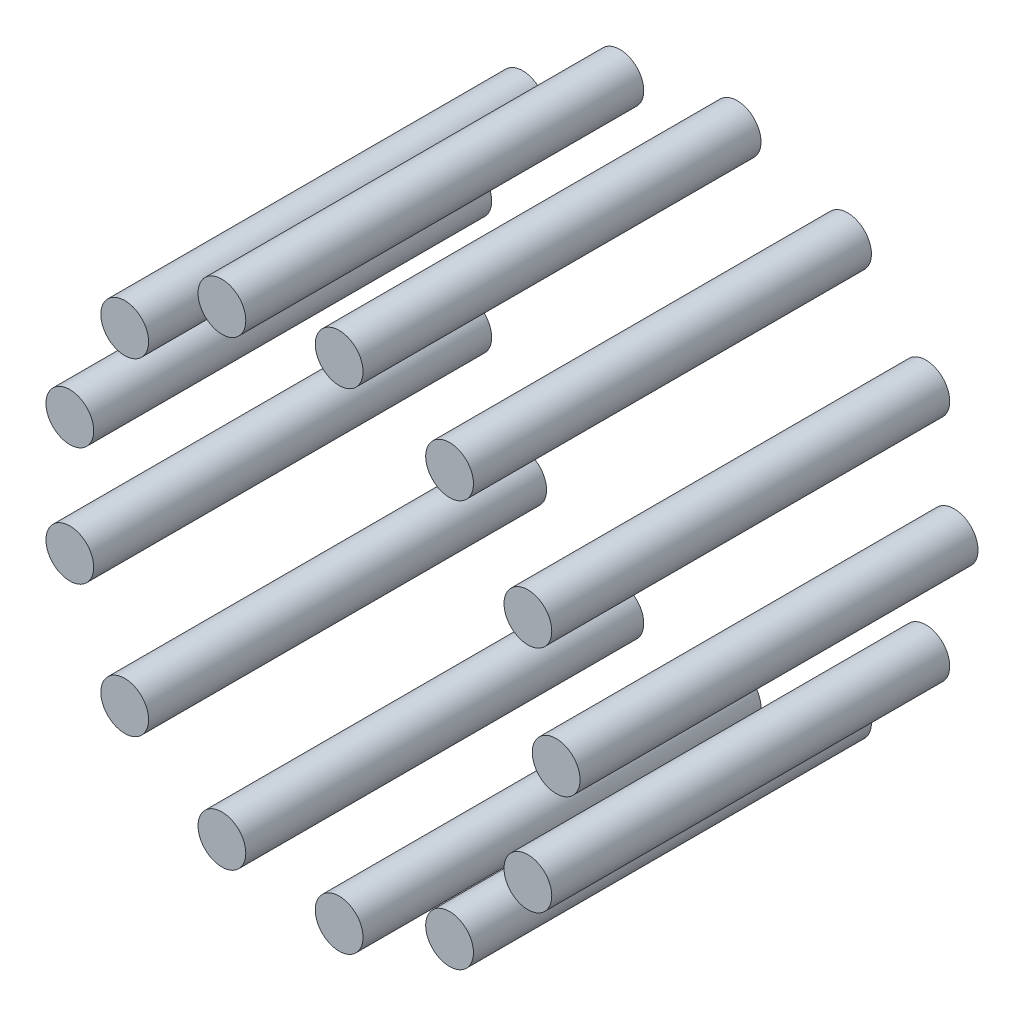
ISO-10303-21;
HEADER;
FILE_DESCRIPTION(('STEP AP214'),'2;1');
FILE_NAME('part.step','',(''),(''),'','','');
FILE_SCHEMA(('AUTOMOTIVE_DESIGN { 1 0 10303 214 1 1 1 1 }'));
ENDSEC;
DATA;
#1=APPLICATION_CONTEXT('core data for automotive mechanical design processes');
#2=APPLICATION_PROTOCOL_DEFINITION('international standard','automotive_design',2000,#1);
#3=PRODUCT_CONTEXT('',#1,'mechanical');
#4=PRODUCT('Part','Part','',(#3));
#5=PRODUCT_RELATED_PRODUCT_CATEGORY('part','',(#4));
#6=PRODUCT_DEFINITION_FORMATION('','',#4);
#7=PRODUCT_DEFINITION_CONTEXT('part definition',#1,'design');
#8=PRODUCT_DEFINITION('design','',#6,#7);
#9=PRODUCT_DEFINITION_SHAPE('','',#8);
#10=(LENGTH_UNIT() NAMED_UNIT(*) SI_UNIT(.MILLI.,.METRE.));
#11=(NAMED_UNIT(*) PLANE_ANGLE_UNIT() SI_UNIT($,.RADIAN.));
#12=(NAMED_UNIT(*) SI_UNIT($,.STERADIAN.) SOLID_ANGLE_UNIT());
#13=UNCERTAINTY_MEASURE_WITH_UNIT(LENGTH_MEASURE(1.E-05),#10,'distance_accuracy_value','');
#14=(GEOMETRIC_REPRESENTATION_CONTEXT(3) GLOBAL_UNCERTAINTY_ASSIGNED_CONTEXT((#13)) GLOBAL_UNIT_ASSIGNED_CONTEXT((#10,
#11,#12)) REPRESENTATION_CONTEXT('',''));
#15=CARTESIAN_POINT('',(0.,0.,0.));
#16=DIRECTION('',(0.,0.,1.));
#17=DIRECTION('',(1.,0.,0.));
#18=AXIS2_PLACEMENT_3D('',#15,#16,#17);
#19=CARTESIAN_POINT('',(27.4491367952504,14.4064183333573,50.));
#20=DIRECTION('',(0.,0.,-1.));
#21=DIRECTION('',(-1.,0.,0.));
#22=AXIS2_PLACEMENT_3D('',#19,#20,#21);
#23=CYLINDRICAL_SURFACE('',#22,2.99999999999889);
#24=CARTESIAN_POINT('',(27.4491367952504,14.4064183333573,50.));
#25=DIRECTION('',(0.,0.,1.));
#26=DIRECTION('',(1.,0.,0.));
#27=AXIS2_PLACEMENT_3D('',#24,#25,#26);
#28=CIRCLE('',#27,2.99999999999889);
#29=CARTESIAN_POINT('',(30.4491367952493,14.4064183333573,50.));
#30=VERTEX_POINT('',#29);
#31=EDGE_CURVE('E56',#30,#30,#28,.T.);
#32=ORIENTED_EDGE('',*,*,#31,.F.);
#33=EDGE_LOOP('',(#32));
#34=FACE_BOUND('',#33,.T.);
#35=CARTESIAN_POINT('',(27.4491367952504,14.4064183333573,0.));
#36=DIRECTION('',(0.,0.,1.));
#37=DIRECTION('',(1.,0.,0.));
#38=AXIS2_PLACEMENT_3D('',#35,#36,#37);
#39=CIRCLE('',#38,2.99999999999889);
#40=CARTESIAN_POINT('',(30.4491367952493,14.4064183333573,0.));
#41=VERTEX_POINT('',#40);
#42=EDGE_CURVE('E11',#41,#41,#39,.T.);
#43=ORIENTED_EDGE('',*,*,#42,.T.);
#44=EDGE_LOOP('',(#43));
#45=FACE_BOUND('',#44,.T.);
#46=ADVANCED_FACE('F52',(#34,#45),#23,.T.);
#47=CARTESIAN_POINT('',(27.4491367952504,14.4064183333573,50.));
#48=DIRECTION('',(0.,0.,1.));
#49=DIRECTION('',(1.,0.,0.));
#50=AXIS2_PLACEMENT_3D('',#47,#48,#49);
#51=PLANE('',#50);
#52=ORIENTED_EDGE('',*,*,#31,.T.);
#53=EDGE_LOOP('',(#52));
#54=FACE_BOUND('',#53,.T.);
#55=ADVANCED_FACE('F54',(#54),#51,.T.);
#56=CARTESIAN_POINT('',(27.4491367952504,14.4064183333573,0.));
#57=DIRECTION('',(0.,0.,1.));
#58=DIRECTION('',(1.,0.,0.));
#59=AXIS2_PLACEMENT_3D('',#56,#57,#58);
#60=PLANE('',#59);
#61=ORIENTED_EDGE('',*,*,#42,.F.);
#62=EDGE_LOOP('',(#61));
#63=FACE_BOUND('',#62,.T.);
#64=ADVANCED_FACE('F71',(#63),#60,.F.);
#65=CLOSED_SHELL('',(#46,#55,#64));
#66=MANIFOLD_SOLID_BREP('B2',#65);
#67=CARTESIAN_POINT('',(17.6100071486674,25.5124998427047,50.));
#68=DIRECTION('',(0.,0.,-1.));
#69=DIRECTION('',(-1.,0.,0.));
#70=AXIS2_PLACEMENT_3D('',#67,#68,#69);
#71=CYLINDRICAL_SURFACE('',#70,2.99999999999815);
#72=CARTESIAN_POINT('',(17.6100071486674,25.5124998427047,50.));
#73=DIRECTION('',(0.,0.,1.));
#74=DIRECTION('',(1.,0.,0.));
#75=AXIS2_PLACEMENT_3D('',#72,#73,#74);
#76=CIRCLE('',#75,2.99999999999815);
#77=CARTESIAN_POINT('',(20.6100071486655,25.5124998427047,50.));
#78=VERTEX_POINT('',#77);
#79=EDGE_CURVE('E105',#78,#78,#76,.T.);
#80=ORIENTED_EDGE('',*,*,#79,.F.);
#81=EDGE_LOOP('',(#80));
#82=FACE_BOUND('',#81,.T.);
#83=CARTESIAN_POINT('',(17.6100071486674,25.5124998427047,0.));
#84=DIRECTION('',(0.,0.,1.));
#85=DIRECTION('',(1.,0.,0.));
#86=AXIS2_PLACEMENT_3D('',#83,#84,#85);
#87=CIRCLE('',#86,2.99999999999815);
#88=CARTESIAN_POINT('',(20.6100071486655,25.5124998427047,0.));
#89=VERTEX_POINT('',#88);
#90=EDGE_CURVE('E51',#89,#89,#87,.T.);
#91=ORIENTED_EDGE('',*,*,#90,.T.);
#92=EDGE_LOOP('',(#91));
#93=FACE_BOUND('',#92,.T.);
#94=ADVANCED_FACE('F101',(#82,#93),#71,.T.);
#95=CARTESIAN_POINT('',(17.6100071486674,25.5124998427047,50.));
#96=DIRECTION('',(0.,0.,1.));
#97=DIRECTION('',(1.,0.,0.));
#98=AXIS2_PLACEMENT_3D('',#95,#96,#97);
#99=PLANE('',#98);
#100=ORIENTED_EDGE('',*,*,#79,.T.);
#101=EDGE_LOOP('',(#100));
#102=FACE_BOUND('',#101,.T.);
#103=ADVANCED_FACE('F103',(#102),#99,.T.);
#104=CARTESIAN_POINT('',(17.6100071486674,25.5124998427047,0.));
#105=DIRECTION('',(0.,0.,1.));
#106=DIRECTION('',(1.,0.,0.));
#107=AXIS2_PLACEMENT_3D('',#104,#105,#106);
#108=PLANE('',#107);
#109=ORIENTED_EDGE('',*,*,#90,.F.);
#110=EDGE_LOOP('',(#109));
#111=FACE_BOUND('',#110,.T.);
#112=ADVANCED_FACE('F120',(#111),#108,.F.);
#113=CLOSED_SHELL('',(#94,#103,#112));
#114=MANIFOLD_SOLID_BREP('B6',#113);
#115=CARTESIAN_POINT('',(3.73663708791669,30.773975097042,50.));
#116=DIRECTION('',(0.,0.,-1.));
#117=DIRECTION('',(-1.,0.,0.));
#118=AXIS2_PLACEMENT_3D('',#115,#116,#117);
#119=CYLINDRICAL_SURFACE('',#118,2.99999999999788);
#120=CARTESIAN_POINT('',(3.73663708791669,30.773975097042,50.));
#121=DIRECTION('',(0.,0.,1.));
#122=DIRECTION('',(1.,0.,0.));
#123=AXIS2_PLACEMENT_3D('',#120,#121,#122);
#124=CIRCLE('',#123,2.99999999999788);
#125=CARTESIAN_POINT('',(6.73663708791456,30.773975097042,50.));
#126=VERTEX_POINT('',#125);
#127=EDGE_CURVE('E154',#126,#126,#124,.T.);
#128=ORIENTED_EDGE('',*,*,#127,.F.);
#129=EDGE_LOOP('',(#128));
#130=FACE_BOUND('',#129,.T.);
#131=CARTESIAN_POINT('',(3.73663708791669,30.773975097042,0.));
#132=DIRECTION('',(0.,0.,1.));
#133=DIRECTION('',(1.,0.,0.));
#134=AXIS2_PLACEMENT_3D('',#131,#132,#133);
#135=CIRCLE('',#134,2.99999999999788);
#136=CARTESIAN_POINT('',(6.73663708791456,30.773975097042,0.));
#137=VERTEX_POINT('',#136);
#138=EDGE_CURVE('E100',#137,#137,#135,.T.);
#139=ORIENTED_EDGE('',*,*,#138,.T.);
#140=EDGE_LOOP('',(#139));
#141=FACE_BOUND('',#140,.T.);
#142=ADVANCED_FACE('F150',(#130,#141),#119,.T.);
#143=CARTESIAN_POINT('',(3.73663708791669,30.773975097042,50.));
#144=DIRECTION('',(0.,0.,1.));
#145=DIRECTION('',(1.,0.,0.));
#146=AXIS2_PLACEMENT_3D('',#143,#144,#145);
#147=PLANE('',#146);
#148=ORIENTED_EDGE('',*,*,#127,.T.);
#149=EDGE_LOOP('',(#148));
#150=FACE_BOUND('',#149,.T.);
#151=ADVANCED_FACE('F152',(#150),#147,.T.);
#152=CARTESIAN_POINT('',(3.73663708791669,30.773975097042,0.));
#153=DIRECTION('',(0.,0.,1.));
#154=DIRECTION('',(1.,0.,0.));
#155=AXIS2_PLACEMENT_3D('',#152,#153,#154);
#156=PLANE('',#155);
#157=ORIENTED_EDGE('',*,*,#138,.F.);
#158=EDGE_LOOP('',(#157));
#159=FACE_BOUND('',#158,.T.);
#160=ADVANCED_FACE('F169',(#159),#156,.F.);
#161=CLOSED_SHELL('',(#142,#151,#160));
#162=MANIFOLD_SOLID_BREP('B46',#161);
#163=CARTESIAN_POINT('',(-10.9927514983173,28.9855035232512,50.));
#164=DIRECTION('',(0.,0.,-1.));
#165=DIRECTION('',(-1.,0.,0.));
#166=AXIS2_PLACEMENT_3D('',#163,#164,#165);
#167=CYLINDRICAL_SURFACE('',#166,2.99999999999808);
#168=CARTESIAN_POINT('',(-10.9927514983173,28.9855035232512,50.));
#169=DIRECTION('',(0.,0.,1.));
#170=DIRECTION('',(1.,0.,0.));
#171=AXIS2_PLACEMENT_3D('',#168,#169,#170);
#172=CIRCLE('',#171,2.99999999999808);
#173=CARTESIAN_POINT('',(-7.99275149831919,28.9855035232512,50.));
#174=VERTEX_POINT('',#173);
#175=EDGE_CURVE('E203',#174,#174,#172,.T.);
#176=ORIENTED_EDGE('',*,*,#175,.F.);
#177=EDGE_LOOP('',(#176));
#178=FACE_BOUND('',#177,.T.);
#179=CARTESIAN_POINT('',(-10.9927514983173,28.9855035232512,0.));
#180=DIRECTION('',(0.,0.,1.));
#181=DIRECTION('',(1.,0.,0.));
#182=AXIS2_PLACEMENT_3D('',#179,#180,#181);
#183=CIRCLE('',#182,2.99999999999808);
#184=CARTESIAN_POINT('',(-7.99275149831919,28.9855035232512,0.));
#185=VERTEX_POINT('',#184);
#186=EDGE_CURVE('E149',#185,#185,#183,.T.);
#187=ORIENTED_EDGE('',*,*,#186,.T.);
#188=EDGE_LOOP('',(#187));
#189=FACE_BOUND('',#188,.T.);
#190=ADVANCED_FACE('F199',(#178,#189),#167,.T.);
#191=CARTESIAN_POINT('',(-10.9927514983173,28.9855035232512,50.));
#192=DIRECTION('',(0.,0.,1.));
#193=DIRECTION('',(1.,0.,0.));
#194=AXIS2_PLACEMENT_3D('',#191,#192,#193);
#195=PLANE('',#194);
#196=ORIENTED_EDGE('',*,*,#175,.T.);
#197=EDGE_LOOP('',(#196));
#198=FACE_BOUND('',#197,.T.);
#199=ADVANCED_FACE('F201',(#198),#195,.T.);
#200=CARTESIAN_POINT('',(-10.9927514983173,28.9855035232512,0.));
#201=DIRECTION('',(0.,0.,1.));
#202=DIRECTION('',(1.,0.,0.));
#203=AXIS2_PLACEMENT_3D('',#200,#201,#202);
#204=PLANE('',#203);
#205=ORIENTED_EDGE('',*,*,#186,.F.);
#206=EDGE_LOOP('',(#205));
#207=FACE_BOUND('',#206,.T.);
#208=ADVANCED_FACE('F218',(#207),#204,.F.);
#209=CLOSED_SHELL('',(#190,#199,#208));
#210=MANIFOLD_SOLID_BREP('B95',#209);
#211=CARTESIAN_POINT('',(-23.2038331933036,20.5568024054687,50.));
#212=DIRECTION('',(0.,0.,-1.));
#213=DIRECTION('',(-1.,0.,0.));
#214=AXIS2_PLACEMENT_3D('',#211,#212,#213);
#215=CYLINDRICAL_SURFACE('',#214,2.99999999999875);
#216=CARTESIAN_POINT('',(-23.2038331933036,20.5568024054687,50.));
#217=DIRECTION('',(0.,0.,1.));
#218=DIRECTION('',(1.,0.,0.));
#219=AXIS2_PLACEMENT_3D('',#216,#217,#218);
#220=CIRCLE('',#219,2.99999999999875);
#221=CARTESIAN_POINT('',(-20.2038331933048,20.5568024054687,50.));
#222=VERTEX_POINT('',#221);
#223=EDGE_CURVE('E252',#222,#222,#220,.T.);
#224=ORIENTED_EDGE('',*,*,#223,.F.);
#225=EDGE_LOOP('',(#224));
#226=FACE_BOUND('',#225,.T.);
#227=CARTESIAN_POINT('',(-23.2038331933036,20.5568024054687,0.));
#228=DIRECTION('',(0.,0.,1.));
#229=DIRECTION('',(1.,0.,0.));
#230=AXIS2_PLACEMENT_3D('',#227,#228,#229);
#231=CIRCLE('',#230,2.99999999999875);
#232=CARTESIAN_POINT('',(-20.2038331933048,20.5568024054687,0.));
#233=VERTEX_POINT('',#232);
#234=EDGE_CURVE('E198',#233,#233,#231,.T.);
#235=ORIENTED_EDGE('',*,*,#234,.T.);
#236=EDGE_LOOP('',(#235));
#237=FACE_BOUND('',#236,.T.);
#238=ADVANCED_FACE('F248',(#226,#237),#215,.T.);
#239=CARTESIAN_POINT('',(-23.2038331933036,20.5568024054687,50.));
#240=DIRECTION('',(0.,0.,1.));
#241=DIRECTION('',(1.,0.,0.));
#242=AXIS2_PLACEMENT_3D('',#239,#240,#241);
#243=PLANE('',#242);
#244=ORIENTED_EDGE('',*,*,#223,.T.);
#245=EDGE_LOOP('',(#244));
#246=FACE_BOUND('',#245,.T.);
#247=ADVANCED_FACE('F250',(#246),#243,.T.);
#248=CARTESIAN_POINT('',(-23.2038331933036,20.5568024054687,0.));
#249=DIRECTION('',(0.,0.,1.));
#250=DIRECTION('',(1.,0.,0.));
#251=AXIS2_PLACEMENT_3D('',#248,#249,#250);
#252=PLANE('',#251);
#253=ORIENTED_EDGE('',*,*,#234,.F.);
#254=EDGE_LOOP('',(#253));
#255=FACE_BOUND('',#254,.T.);
#256=ADVANCED_FACE('F267',(#255),#252,.F.);
#257=CLOSED_SHELL('',(#238,#247,#256));
#258=MANIFOLD_SOLID_BREP('B144',#257);
#259=CARTESIAN_POINT('',(-30.0991963402081,7.4187855929186,50.));
#260=DIRECTION('',(0.,0.,-1.));
#261=DIRECTION('',(-1.,0.,0.));
#262=AXIS2_PLACEMENT_3D('',#259,#260,#261);
#263=CYLINDRICAL_SURFACE('',#262,2.99999999999972);
#264=CARTESIAN_POINT('',(-30.0991963402081,7.4187855929186,50.));
#265=DIRECTION('',(0.,0.,1.));
#266=DIRECTION('',(1.,0.,0.));
#267=AXIS2_PLACEMENT_3D('',#264,#265,#266);
#268=CIRCLE('',#267,2.99999999999972);
#269=CARTESIAN_POINT('',(-27.0991963402084,7.4187855929186,50.));
#270=VERTEX_POINT('',#269);
#271=EDGE_CURVE('E301',#270,#270,#268,.T.);
#272=ORIENTED_EDGE('',*,*,#271,.F.);
#273=EDGE_LOOP('',(#272));
#274=FACE_BOUND('',#273,.T.);
#275=CARTESIAN_POINT('',(-30.0991963402081,7.4187855929186,0.));
#276=DIRECTION('',(0.,0.,1.));
#277=DIRECTION('',(1.,0.,0.));
#278=AXIS2_PLACEMENT_3D('',#275,#276,#277);
#279=CIRCLE('',#278,2.99999999999972);
#280=CARTESIAN_POINT('',(-27.0991963402084,7.4187855929186,0.));
#281=VERTEX_POINT('',#280);
#282=EDGE_CURVE('E247',#281,#281,#279,.T.);
#283=ORIENTED_EDGE('',*,*,#282,.T.);
#284=EDGE_LOOP('',(#283));
#285=FACE_BOUND('',#284,.T.);
#286=ADVANCED_FACE('F297',(#274,#285),#263,.T.);
#287=CARTESIAN_POINT('',(-30.0991963402081,7.4187855929186,50.));
#288=DIRECTION('',(0.,0.,1.));
#289=DIRECTION('',(1.,0.,0.));
#290=AXIS2_PLACEMENT_3D('',#287,#288,#289);
#291=PLANE('',#290);
#292=ORIENTED_EDGE('',*,*,#271,.T.);
#293=EDGE_LOOP('',(#292));
#294=FACE_BOUND('',#293,.T.);
#295=ADVANCED_FACE('F299',(#294),#291,.T.);
#296=CARTESIAN_POINT('',(-30.0991963402081,7.4187855929186,0.));
#297=DIRECTION('',(0.,0.,1.));
#298=DIRECTION('',(1.,0.,0.));
#299=AXIS2_PLACEMENT_3D('',#296,#297,#298);
#300=PLANE('',#299);
#301=ORIENTED_EDGE('',*,*,#282,.F.);
#302=EDGE_LOOP('',(#301));
#303=FACE_BOUND('',#302,.T.);
#304=ADVANCED_FACE('F316',(#303),#300,.F.);
#305=CLOSED_SHELL('',(#286,#295,#304));
#306=MANIFOLD_SOLID_BREP('B193',#305);
#307=CARTESIAN_POINT('',(-30.0991963402091,-7.41878559291021,50.));
#308=DIRECTION('',(0.,0.,-1.));
#309=DIRECTION('',(-1.,0.,0.));
#310=AXIS2_PLACEMENT_3D('',#307,#308,#309);
#311=CYLINDRICAL_SURFACE('',#310,3.00000000000078);
#312=CARTESIAN_POINT('',(-30.0991963402091,-7.41878559291021,50.));
#313=DIRECTION('',(0.,0.,1.));
#314=DIRECTION('',(1.,0.,0.));
#315=AXIS2_PLACEMENT_3D('',#312,#313,#314);
#316=CIRCLE('',#315,3.00000000000078);
#317=CARTESIAN_POINT('',(-27.0991963402083,-7.41878559291021,50.));
#318=VERTEX_POINT('',#317);
#319=EDGE_CURVE('E350',#318,#318,#316,.T.);
#320=ORIENTED_EDGE('',*,*,#319,.F.);
#321=EDGE_LOOP('',(#320));
#322=FACE_BOUND('',#321,.T.);
#323=CARTESIAN_POINT('',(-30.0991963402091,-7.41878559291021,0.));
#324=DIRECTION('',(0.,0.,1.));
#325=DIRECTION('',(1.,0.,0.));
#326=AXIS2_PLACEMENT_3D('',#323,#324,#325);
#327=CIRCLE('',#326,3.00000000000078);
#328=CARTESIAN_POINT('',(-27.0991963402083,-7.41878559291021,0.));
#329=VERTEX_POINT('',#328);
#330=EDGE_CURVE('E296',#329,#329,#327,.T.);
#331=ORIENTED_EDGE('',*,*,#330,.T.);
#332=EDGE_LOOP('',(#331));
#333=FACE_BOUND('',#332,.T.);
#334=ADVANCED_FACE('F346',(#322,#333),#311,.T.);
#335=CARTESIAN_POINT('',(-30.0991963402091,-7.41878559291021,50.));
#336=DIRECTION('',(0.,0.,1.));
#337=DIRECTION('',(1.,0.,0.));
#338=AXIS2_PLACEMENT_3D('',#335,#336,#337);
#339=PLANE('',#338);
#340=ORIENTED_EDGE('',*,*,#319,.T.);
#341=EDGE_LOOP('',(#340));
#342=FACE_BOUND('',#341,.T.);
#343=ADVANCED_FACE('F348',(#342),#339,.T.);
#344=CARTESIAN_POINT('',(-30.0991963402091,-7.41878559291021,0.));
#345=DIRECTION('',(0.,0.,1.));
#346=DIRECTION('',(1.,0.,0.));
#347=AXIS2_PLACEMENT_3D('',#344,#345,#346);
#348=PLANE('',#347);
#349=ORIENTED_EDGE('',*,*,#330,.F.);
#350=EDGE_LOOP('',(#349));
#351=FACE_BOUND('',#350,.T.);
#352=ADVANCED_FACE('F365',(#351),#348,.F.);
#353=CLOSED_SHELL('',(#334,#343,#352));
#354=MANIFOLD_SOLID_BREP('B242',#353);
#355=CARTESIAN_POINT('',(-23.2038331933064,-20.5568024054613,50.));
#356=DIRECTION('',(0.,0.,-1.));
#357=DIRECTION('',(-1.,0.,0.));
#358=AXIS2_PLACEMENT_3D('',#355,#356,#357);
#359=CYLINDRICAL_SURFACE('',#358,3.00000000000168);
#360=CARTESIAN_POINT('',(-23.2038331933064,-20.5568024054613,50.));
#361=DIRECTION('',(0.,0.,1.));
#362=DIRECTION('',(1.,0.,0.));
#363=AXIS2_PLACEMENT_3D('',#360,#361,#362);
#364=CIRCLE('',#363,3.00000000000168);
#365=CARTESIAN_POINT('',(-20.2038331933047,-20.5568024054613,50.));
#366=VERTEX_POINT('',#365);
#367=EDGE_CURVE('E399',#366,#366,#364,.T.);
#368=ORIENTED_EDGE('',*,*,#367,.F.);
#369=EDGE_LOOP('',(#368));
#370=FACE_BOUND('',#369,.T.);
#371=CARTESIAN_POINT('',(-23.2038331933064,-20.5568024054613,0.));
#372=DIRECTION('',(0.,0.,1.));
#373=DIRECTION('',(1.,0.,0.));
#374=AXIS2_PLACEMENT_3D('',#371,#372,#373);
#375=CIRCLE('',#374,3.00000000000168);
#376=CARTESIAN_POINT('',(-20.2038331933047,-20.5568024054613,0.));
#377=VERTEX_POINT('',#376);
#378=EDGE_CURVE('E345',#377,#377,#375,.T.);
#379=ORIENTED_EDGE('',*,*,#378,.T.);
#380=EDGE_LOOP('',(#379));
#381=FACE_BOUND('',#380,.T.);
#382=ADVANCED_FACE('F395',(#370,#381),#359,.T.);
#383=CARTESIAN_POINT('',(-23.2038331933064,-20.5568024054613,50.));
#384=DIRECTION('',(0.,0.,1.));
#385=DIRECTION('',(1.,0.,0.));
#386=AXIS2_PLACEMENT_3D('',#383,#384,#385);
#387=PLANE('',#386);
#388=ORIENTED_EDGE('',*,*,#367,.T.);
#389=EDGE_LOOP('',(#388));
#390=FACE_BOUND('',#389,.T.);
#391=ADVANCED_FACE('F397',(#390),#387,.T.);
#392=CARTESIAN_POINT('',(-23.2038331933064,-20.5568024054613,0.));
#393=DIRECTION('',(0.,0.,1.));
#394=DIRECTION('',(1.,0.,0.));
#395=AXIS2_PLACEMENT_3D('',#392,#393,#394);
#396=PLANE('',#395);
#397=ORIENTED_EDGE('',*,*,#378,.F.);
#398=EDGE_LOOP('',(#397));
#399=FACE_BOUND('',#398,.T.);
#400=ADVANCED_FACE('F414',(#399),#396,.F.);
#401=CLOSED_SHELL('',(#382,#391,#400));
#402=MANIFOLD_SOLID_BREP('B291',#401);
#403=CARTESIAN_POINT('',(-10.9927514983213,-28.9855035232454,50.));
#404=DIRECTION('',(0.,0.,-1.));
#405=DIRECTION('',(-1.,0.,0.));
#406=AXIS2_PLACEMENT_3D('',#403,#404,#405);
#407=CYLINDRICAL_SURFACE('',#406,3.00000000000221);
#408=CARTESIAN_POINT('',(-10.9927514983213,-28.9855035232454,50.));
#409=DIRECTION('',(0.,0.,1.));
#410=DIRECTION('',(1.,0.,0.));
#411=AXIS2_PLACEMENT_3D('',#408,#409,#410);
#412=CIRCLE('',#411,3.00000000000221);
#413=CARTESIAN_POINT('',(-7.99275149831904,-28.9855035232454,50.));
#414=VERTEX_POINT('',#413);
#415=EDGE_CURVE('E448',#414,#414,#412,.T.);
#416=ORIENTED_EDGE('',*,*,#415,.F.);
#417=EDGE_LOOP('',(#416));
#418=FACE_BOUND('',#417,.T.);
#419=CARTESIAN_POINT('',(-10.9927514983213,-28.9855035232454,0.));
#420=DIRECTION('',(0.,0.,1.));
#421=DIRECTION('',(1.,0.,0.));
#422=AXIS2_PLACEMENT_3D('',#419,#420,#421);
#423=CIRCLE('',#422,3.00000000000221);
#424=CARTESIAN_POINT('',(-7.99275149831904,-28.9855035232454,0.));
#425=VERTEX_POINT('',#424);
#426=EDGE_CURVE('E394',#425,#425,#423,.T.);
#427=ORIENTED_EDGE('',*,*,#426,.T.);
#428=EDGE_LOOP('',(#427));
#429=FACE_BOUND('',#428,.T.);
#430=ADVANCED_FACE('F444',(#418,#429),#407,.T.);
#431=CARTESIAN_POINT('',(-10.9927514983213,-28.9855035232454,50.));
#432=DIRECTION('',(0.,0.,1.));
#433=DIRECTION('',(1.,0.,0.));
#434=AXIS2_PLACEMENT_3D('',#431,#432,#433);
#435=PLANE('',#434);
#436=ORIENTED_EDGE('',*,*,#415,.T.);
#437=EDGE_LOOP('',(#436));
#438=FACE_BOUND('',#437,.T.);
#439=ADVANCED_FACE('F446',(#438),#435,.T.);
#440=CARTESIAN_POINT('',(-10.9927514983213,-28.9855035232454,0.));
#441=DIRECTION('',(0.,0.,1.));
#442=DIRECTION('',(1.,0.,0.));
#443=AXIS2_PLACEMENT_3D('',#440,#441,#442);
#444=PLANE('',#443);
#445=ORIENTED_EDGE('',*,*,#426,.F.);
#446=EDGE_LOOP('',(#445));
#447=FACE_BOUND('',#446,.T.);
#448=ADVANCED_FACE('F463',(#447),#444,.F.);
#449=CLOSED_SHELL('',(#430,#439,#448));
#450=MANIFOLD_SOLID_BREP('B340',#449);
#451=CARTESIAN_POINT('',(3.73663708791247,-30.7739750970383,50.));
#452=DIRECTION('',(0.,0.,-1.));
#453=DIRECTION('',(-1.,0.,0.));
#454=AXIS2_PLACEMENT_3D('',#451,#452,#453);
#455=CYLINDRICAL_SURFACE('',#454,3.00000000000228);
#456=CARTESIAN_POINT('',(3.73663708791247,-30.7739750970383,50.));
#457=DIRECTION('',(0.,0.,1.));
#458=DIRECTION('',(1.,0.,0.));
#459=AXIS2_PLACEMENT_3D('',#456,#457,#458);
#460=CIRCLE('',#459,3.00000000000228);
#461=CARTESIAN_POINT('',(6.73663708791475,-30.7739750970383,50.));
#462=VERTEX_POINT('',#461);
#463=EDGE_CURVE('E497',#462,#462,#460,.T.);
#464=ORIENTED_EDGE('',*,*,#463,.F.);
#465=EDGE_LOOP('',(#464));
#466=FACE_BOUND('',#465,.T.);
#467=CARTESIAN_POINT('',(3.73663708791247,-30.7739750970383,0.));
#468=DIRECTION('',(0.,0.,1.));
#469=DIRECTION('',(1.,0.,0.));
#470=AXIS2_PLACEMENT_3D('',#467,#468,#469);
#471=CIRCLE('',#470,3.00000000000228);
#472=CARTESIAN_POINT('',(6.73663708791475,-30.7739750970383,0.));
#473=VERTEX_POINT('',#472);
#474=EDGE_CURVE('E443',#473,#473,#471,.T.);
#475=ORIENTED_EDGE('',*,*,#474,.T.);
#476=EDGE_LOOP('',(#475));
#477=FACE_BOUND('',#476,.T.);
#478=ADVANCED_FACE('F493',(#466,#477),#455,.T.);
#479=CARTESIAN_POINT('',(3.73663708791247,-30.7739750970383,50.));
#480=DIRECTION('',(0.,0.,1.));
#481=DIRECTION('',(1.,0.,0.));
#482=AXIS2_PLACEMENT_3D('',#479,#480,#481);
#483=PLANE('',#482);
#484=ORIENTED_EDGE('',*,*,#463,.T.);
#485=EDGE_LOOP('',(#484));
#486=FACE_BOUND('',#485,.T.);
#487=ADVANCED_FACE('F495',(#486),#483,.T.);
#488=CARTESIAN_POINT('',(3.73663708791247,-30.7739750970383,0.));
#489=DIRECTION('',(0.,0.,1.));
#490=DIRECTION('',(1.,0.,0.));
#491=AXIS2_PLACEMENT_3D('',#488,#489,#490);
#492=PLANE('',#491);
#493=ORIENTED_EDGE('',*,*,#474,.F.);
#494=EDGE_LOOP('',(#493));
#495=FACE_BOUND('',#494,.T.);
#496=ADVANCED_FACE('F514',(#495),#492,.F.);
#497=CLOSED_SHELL('',(#478,#487,#496));
#498=MANIFOLD_SOLID_BREP('B389',#497);
#499=CARTESIAN_POINT('',(17.6100071486639,-25.5124998427028,50.));
#500=DIRECTION('',(0.,0.,-1.));
#501=DIRECTION('',(-1.,0.,0.));
#502=AXIS2_PLACEMENT_3D('',#499,#500,#501);
#503=CYLINDRICAL_SURFACE('',#502,3.00000000000184);
#504=CARTESIAN_POINT('',(17.6100071486639,-25.5124998427028,50.));
#505=DIRECTION('',(0.,0.,1.));
#506=DIRECTION('',(1.,0.,0.));
#507=AXIS2_PLACEMENT_3D('',#504,#505,#506);
#508=CIRCLE('',#507,3.00000000000184);
#509=CARTESIAN_POINT('',(20.6100071486657,-25.5124998427028,50.));
#510=VERTEX_POINT('',#509);
#511=EDGE_CURVE('E548',#510,#510,#508,.T.);
#512=ORIENTED_EDGE('',*,*,#511,.F.);
#513=EDGE_LOOP('',(#512));
#514=FACE_BOUND('',#513,.T.);
#515=CARTESIAN_POINT('',(17.6100071486639,-25.5124998427028,0.));
#516=DIRECTION('',(0.,0.,1.));
#517=DIRECTION('',(1.,0.,0.));
#518=AXIS2_PLACEMENT_3D('',#515,#516,#517);
#519=CIRCLE('',#518,3.00000000000184);
#520=CARTESIAN_POINT('',(20.6100071486657,-25.5124998427028,0.));
#521=VERTEX_POINT('',#520);
#522=EDGE_CURVE('E492',#521,#521,#519,.T.);
#523=ORIENTED_EDGE('',*,*,#522,.T.);
#524=EDGE_LOOP('',(#523));
#525=FACE_BOUND('',#524,.T.);
#526=ADVANCED_FACE('F544',(#514,#525),#503,.T.);
#527=CARTESIAN_POINT('',(17.6100071486639,-25.5124998427028,50.));
#528=DIRECTION('',(0.,0.,1.));
#529=DIRECTION('',(1.,0.,0.));
#530=AXIS2_PLACEMENT_3D('',#527,#528,#529);
#531=PLANE('',#530);
#532=ORIENTED_EDGE('',*,*,#511,.T.);
#533=EDGE_LOOP('',(#532));
#534=FACE_BOUND('',#533,.T.);
#535=ADVANCED_FACE('F546',(#534),#531,.T.);
#536=CARTESIAN_POINT('',(17.6100071486639,-25.5124998427028,0.));
#537=DIRECTION('',(0.,0.,1.));
#538=DIRECTION('',(1.,0.,0.));
#539=AXIS2_PLACEMENT_3D('',#536,#537,#538);
#540=PLANE('',#539);
#541=ORIENTED_EDGE('',*,*,#522,.F.);
#542=EDGE_LOOP('',(#541));
#543=FACE_BOUND('',#542,.T.);
#544=ADVANCED_FACE('F563',(#543),#540,.F.);
#545=CLOSED_SHELL('',(#526,#535,#544));
#546=MANIFOLD_SOLID_BREP('B438',#545);
#547=CARTESIAN_POINT('',(27.4491367952487,-14.4064183333562,50.));
#548=DIRECTION('',(0.,0.,-1.));
#549=DIRECTION('',(-1.,0.,0.));
#550=AXIS2_PLACEMENT_3D('',#547,#548,#549);
#551=CYLINDRICAL_SURFACE('',#550,3.00000000000093);
#552=CARTESIAN_POINT('',(27.4491367952487,-14.4064183333562,50.));
#553=DIRECTION('',(0.,0.,1.));
#554=DIRECTION('',(1.,0.,0.));
#555=AXIS2_PLACEMENT_3D('',#552,#553,#554);
#556=CIRCLE('',#555,3.00000000000093);
#557=CARTESIAN_POINT('',(30.4491367952496,-14.4064183333562,50.));
#558=VERTEX_POINT('',#557);
#559=EDGE_CURVE('E596',#558,#558,#556,.T.);
#560=ORIENTED_EDGE('',*,*,#559,.F.);
#561=EDGE_LOOP('',(#560));
#562=FACE_BOUND('',#561,.T.);
#563=CARTESIAN_POINT('',(27.4491367952487,-14.4064183333562,0.));
#564=DIRECTION('',(0.,0.,1.));
#565=DIRECTION('',(1.,0.,0.));
#566=AXIS2_PLACEMENT_3D('',#563,#564,#565);
#567=CIRCLE('',#566,3.00000000000093);
#568=CARTESIAN_POINT('',(30.4491367952496,-14.4064183333562,0.));
#569=VERTEX_POINT('',#568);
#570=EDGE_CURVE('E543',#569,#569,#567,.T.);
#571=ORIENTED_EDGE('',*,*,#570,.T.);
#572=EDGE_LOOP('',(#571));
#573=FACE_BOUND('',#572,.T.);
#574=ADVANCED_FACE('F592',(#562,#573),#551,.T.);
#575=CARTESIAN_POINT('',(27.4491367952487,-14.4064183333562,50.));
#576=DIRECTION('',(0.,0.,1.));
#577=DIRECTION('',(1.,0.,0.));
#578=AXIS2_PLACEMENT_3D('',#575,#576,#577);
#579=PLANE('',#578);
#580=ORIENTED_EDGE('',*,*,#559,.T.);
#581=EDGE_LOOP('',(#580));
#582=FACE_BOUND('',#581,.T.);
#583=ADVANCED_FACE('F594',(#582),#579,.T.);
#584=CARTESIAN_POINT('',(27.4491367952487,-14.4064183333562,0.));
#585=DIRECTION('',(0.,0.,1.));
#586=DIRECTION('',(1.,0.,0.));
#587=AXIS2_PLACEMENT_3D('',#584,#585,#586);
#588=PLANE('',#587);
#589=ORIENTED_EDGE('',*,*,#570,.F.);
#590=EDGE_LOOP('',(#589));
#591=FACE_BOUND('',#590,.T.);
#592=ADVANCED_FACE('F611',(#591),#588,.F.);
#593=CLOSED_SHELL('',(#574,#583,#592));
#594=MANIFOLD_SOLID_BREP('B487',#593);
#595=CARTESIAN_POINT('',(31.,0.,50.));
#596=DIRECTION('',(0.,0.,-1.));
#597=DIRECTION('',(-1.,0.,0.));
#598=AXIS2_PLACEMENT_3D('',#595,#596,#597);
#599=CYLINDRICAL_SURFACE('',#598,3.);
#600=CARTESIAN_POINT('',(31.,0.,50.));
#601=DIRECTION('',(0.,0.,1.));
#602=DIRECTION('',(1.,0.,0.));
#603=AXIS2_PLACEMENT_3D('',#600,#601,#602);
#604=CIRCLE('',#603,3.);
#605=CARTESIAN_POINT('',(34.,0.,50.));
#606=VERTEX_POINT('',#605);
#607=EDGE_CURVE('E591',#606,#606,#604,.T.);
#608=ORIENTED_EDGE('',*,*,#607,.F.);
#609=EDGE_LOOP('',(#608));
#610=FACE_BOUND('',#609,.T.);
#611=CARTESIAN_POINT('',(31.,0.,0.));
#612=DIRECTION('',(0.,0.,1.));
#613=DIRECTION('',(1.,0.,0.));
#614=AXIS2_PLACEMENT_3D('',#611,#612,#613);
#615=CIRCLE('',#614,3.);
#616=CARTESIAN_POINT('',(34.,0.,0.));
#617=VERTEX_POINT('',#616);
#618=EDGE_CURVE('E636',#617,#617,#615,.T.);
#619=ORIENTED_EDGE('',*,*,#618,.T.);
#620=EDGE_LOOP('',(#619));
#621=FACE_BOUND('',#620,.T.);
#622=ADVANCED_FACE('F633',(#610,#621),#599,.T.);
#623=CARTESIAN_POINT('',(31.,0.,50.));
#624=DIRECTION('',(0.,0.,1.));
#625=DIRECTION('',(1.,0.,0.));
#626=AXIS2_PLACEMENT_3D('',#623,#624,#625);
#627=PLANE('',#626);
#628=ORIENTED_EDGE('',*,*,#607,.T.);
#629=EDGE_LOOP('',(#628));
#630=FACE_BOUND('',#629,.T.);
#631=ADVANCED_FACE('F648',(#630),#627,.T.);
#632=CARTESIAN_POINT('',(31.,0.,0.));
#633=DIRECTION('',(0.,0.,1.));
#634=DIRECTION('',(1.,0.,0.));
#635=AXIS2_PLACEMENT_3D('',#632,#633,#634);
#636=PLANE('',#635);
#637=ORIENTED_EDGE('',*,*,#618,.F.);
#638=EDGE_LOOP('',(#637));
#639=FACE_BOUND('',#638,.T.);
#640=ADVANCED_FACE('F646',(#639),#636,.F.);
#641=CLOSED_SHELL('',(#622,#631,#640));
#642=MANIFOLD_SOLID_BREP('B538',#641);
#643=ADVANCED_BREP_SHAPE_REPRESENTATION('',(#18,#66,#114,#162,#210,#258,#306,#354,#402,#450,
#498,#546,#594,#642),#14);
#644=SHAPE_DEFINITION_REPRESENTATION(#9,#643);
ENDSEC;
END-ISO-10303-21;
